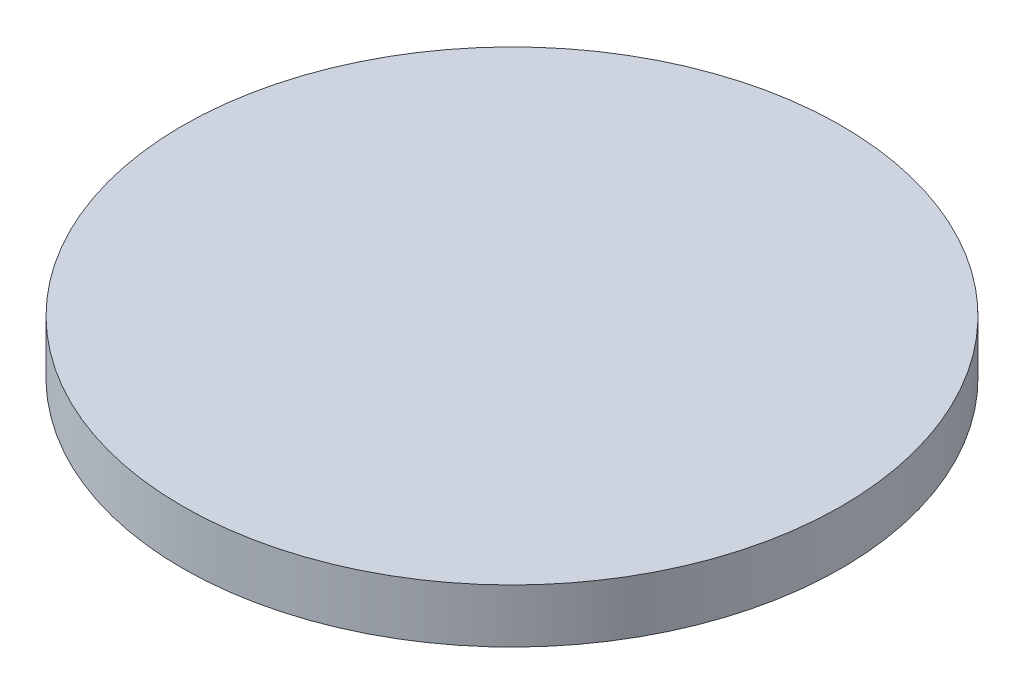
ISO-10303-21;
HEADER;
FILE_DESCRIPTION(('STEP AP214'),'2;1');
FILE_NAME('part.step','',(''),(''),'','','');
FILE_SCHEMA(('AUTOMOTIVE_DESIGN { 1 0 10303 214 1 1 1 1 }'));
ENDSEC;
DATA;
#1=APPLICATION_CONTEXT('core data for automotive mechanical design processes');
#2=APPLICATION_PROTOCOL_DEFINITION('international standard','automotive_design',2000,#1);
#3=PRODUCT_CONTEXT('',#1,'mechanical');
#4=PRODUCT('Part','Part','',(#3));
#5=PRODUCT_RELATED_PRODUCT_CATEGORY('part','',(#4));
#6=PRODUCT_DEFINITION_FORMATION('','',#4);
#7=PRODUCT_DEFINITION_CONTEXT('part definition',#1,'design');
#8=PRODUCT_DEFINITION('design','',#6,#7);
#9=PRODUCT_DEFINITION_SHAPE('','',#8);
#10=(LENGTH_UNIT() NAMED_UNIT(*) SI_UNIT(.MILLI.,.METRE.));
#11=(NAMED_UNIT(*) PLANE_ANGLE_UNIT() SI_UNIT($,.RADIAN.));
#12=(NAMED_UNIT(*) SI_UNIT($,.STERADIAN.) SOLID_ANGLE_UNIT());
#13=UNCERTAINTY_MEASURE_WITH_UNIT(LENGTH_MEASURE(1.E-05),#10,'distance_accuracy_value','');
#14=(GEOMETRIC_REPRESENTATION_CONTEXT(3) GLOBAL_UNCERTAINTY_ASSIGNED_CONTEXT((#13)) GLOBAL_UNIT_ASSIGNED_CONTEXT((#10,
#11,#12)) REPRESENTATION_CONTEXT('',''));
#15=CARTESIAN_POINT('',(0.,0.,0.));
#16=DIRECTION('',(0.,0.,1.));
#17=DIRECTION('',(1.,0.,0.));
#18=AXIS2_PLACEMENT_3D('',#15,#16,#17);
#19=CARTESIAN_POINT('',(67.360135417261,87.9395406480672,103.577321338724));
#20=CARTESIAN_POINT('',(67.8216019712657,87.9395406480672,103.577321338724));
#21=CARTESIAN_POINT('',(68.744535079275,87.9395406480673,103.486420361712));
#22=CARTESIAN_POINT('',(70.0757330386579,87.9395406480672,103.082605875508));
#23=CARTESIAN_POINT('',(71.3025721043753,87.9395406480672,102.426846732863));
#24=CARTESIAN_POINT('',(72.3779055391508,87.9395406480672,101.544343389873));
#25=CARTESIAN_POINT('',(73.26040888214,87.9395406480672,100.469009955098));
#26=CARTESIAN_POINT('',(73.9161680247854,87.9395406480672,99.2421708893806));
#27=CARTESIAN_POINT('',(74.3199825109891,87.9395406480672,97.9109729299976));
#28=CARTESIAN_POINT('',(74.456333976508,87.9395406480672,96.5265732679837));
#29=CARTESIAN_POINT('',(74.3199825109891,87.9395406480672,95.1421736059699));
#30=CARTESIAN_POINT('',(73.9161680247854,87.9395406480672,93.8109756465869));
#31=CARTESIAN_POINT('',(73.26040888214,87.9395406480672,92.5841365808696));
#32=CARTESIAN_POINT('',(72.3779055391508,87.9395406480672,91.508803146094));
#33=CARTESIAN_POINT('',(71.3025721043753,87.9395406480672,90.6262998031048));
#34=CARTESIAN_POINT('',(70.0757330386579,87.9395406480672,89.9705406604594));
#35=CARTESIAN_POINT('',(68.7445350792749,87.9395406480672,89.5667261742557));
#36=CARTESIAN_POINT('',(67.3601354172611,87.9395406480672,89.4303747087368));
#37=CARTESIAN_POINT('',(65.9757357552472,87.9395406480672,89.5667261742557));
#38=CARTESIAN_POINT('',(64.6445377958643,87.9395406480672,89.9705406604594));
#39=CARTESIAN_POINT('',(63.4176987301469,87.9395406480672,90.6262998031048));
#40=CARTESIAN_POINT('',(62.3423652953714,87.9395406480672,91.508803146094));
#41=CARTESIAN_POINT('',(61.4598619523822,87.9395406480672,92.5841365808696));
#42=CARTESIAN_POINT('',(60.8041028097367,87.9395406480672,93.8109756465869));
#43=CARTESIAN_POINT('',(60.4002883235331,87.9395406480672,95.1421736059698));
#44=CARTESIAN_POINT('',(60.2639368580141,87.9395406480672,96.5265732679837));
#45=CARTESIAN_POINT('',(60.4002883235331,87.9395406480672,97.9109729299976));
#46=CARTESIAN_POINT('',(60.8041028097367,87.9395406480672,99.2421708893806));
#47=CARTESIAN_POINT('',(61.4598619523821,87.9395406480672,100.469009955098));
#48=CARTESIAN_POINT('',(62.3423652953714,87.9395406480672,101.544343389873));
#49=CARTESIAN_POINT('',(63.4176987301469,87.9395406480672,102.426846732863));
#50=CARTESIAN_POINT('',(64.6445377958643,87.9395406480672,103.082605875508));
#51=CARTESIAN_POINT('',(65.9757357552472,87.9395406480672,103.486420361712));
#52=CARTESIAN_POINT('',(66.8986688632564,87.9395406480672,103.577321338724));
#53=CARTESIAN_POINT('',(67.360135417261,87.9395406480672,103.577321338724));
#54=B_SPLINE_CURVE_WITH_KNOTS('',3,(#19,#20,#21,#22,#23,#24,#25,#26,#27,#28,#29,#30,#31,#32,#33,
#34,#35,#36,#37,#38,#39,#40,#41,#42,#43,#44,#45,#46,#47,#48,#49,#50,#51,#52,#53),.UNSPECIFIED.,
.T.,.F.,(4,1,1,1,1,1,1,1,1,1,1,1,1,1,1,1,1,1,1,1,1,1,1,1,1,1,1,1,1,1,1,1,4),(0.,
0.0312499999999999,0.0625000000000001,0.0937499999999999,0.125,0.15625,0.1875,0.21875,0.25,
0.28125,0.3125,0.34375,0.375,0.40625,0.4375,0.46875,0.5,0.53125,0.5625,0.59375,0.625,0.65625,
0.6875,0.71875,0.75,0.78125,0.8125,0.84375,0.875,0.90625,0.9375,0.96875,1.),.UNSPECIFIED.);
#55=DIRECTION('',(0.,1.,0.));
#56=VECTOR('',#55,1.);
#57=SURFACE_OF_LINEAR_EXTRUSION('',#54,#56);
#58=CARTESIAN_POINT('',(67.360135417261,87.9395406480672,103.577321338724));
#59=CARTESIAN_POINT('',(67.8216019712657,87.9395406480672,103.577321338724));
#60=CARTESIAN_POINT('',(68.744535079275,87.9395406480673,103.486420361712));
#61=CARTESIAN_POINT('',(70.0757330386579,87.9395406480672,103.082605875508));
#62=CARTESIAN_POINT('',(71.3025721043753,87.9395406480672,102.426846732863));
#63=CARTESIAN_POINT('',(72.3779055391508,87.9395406480672,101.544343389873));
#64=CARTESIAN_POINT('',(73.26040888214,87.9395406480673,100.469009955098));
#65=CARTESIAN_POINT('',(73.9161680247854,87.9395406480672,99.2421708893806));
#66=CARTESIAN_POINT('',(74.3199825109891,87.9395406480672,97.9109729299976));
#67=CARTESIAN_POINT('',(74.456333976508,87.9395406480672,96.5265732679837));
#68=CARTESIAN_POINT('',(74.3199825109891,87.9395406480672,95.1421736059699));
#69=CARTESIAN_POINT('',(73.9161680247854,87.9395406480672,93.8109756465869));
#70=CARTESIAN_POINT('',(73.26040888214,87.9395406480672,92.5841365808696));
#71=CARTESIAN_POINT('',(72.3779055391508,87.9395406480673,91.508803146094));
#72=CARTESIAN_POINT('',(71.3025721043753,87.9395406480672,90.6262998031048));
#73=CARTESIAN_POINT('',(70.0757330386579,87.9395406480672,89.9705406604594));
#74=CARTESIAN_POINT('',(68.7445350792749,87.9395406480673,89.5667261742557));
#75=CARTESIAN_POINT('',(67.3601354172611,87.9395406480672,89.4303747087368));
#76=CARTESIAN_POINT('',(65.9757357552472,87.9395406480672,89.5667261742557));
#77=CARTESIAN_POINT('',(64.6445377958643,87.9395406480673,89.9705406604594));
#78=CARTESIAN_POINT('',(63.4176987301469,87.9395406480673,90.6262998031048));
#79=CARTESIAN_POINT('',(62.3423652953714,87.9395406480672,91.508803146094));
#80=CARTESIAN_POINT('',(61.4598619523822,87.9395406480672,92.5841365808696));
#81=CARTESIAN_POINT('',(60.8041028097367,87.9395406480673,93.8109756465869));
#82=CARTESIAN_POINT('',(60.4002883235331,87.9395406480672,95.1421736059698));
#83=CARTESIAN_POINT('',(60.2639368580141,87.9395406480673,96.5265732679837));
#84=CARTESIAN_POINT('',(60.4002883235331,87.9395406480672,97.9109729299976));
#85=CARTESIAN_POINT('',(60.8041028097367,87.9395406480673,99.2421708893806));
#86=CARTESIAN_POINT('',(61.4598619523821,87.9395406480673,100.469009955098));
#87=CARTESIAN_POINT('',(62.3423652953714,87.9395406480673,101.544343389873));
#88=CARTESIAN_POINT('',(63.4176987301469,87.9395406480672,102.426846732863));
#89=CARTESIAN_POINT('',(64.6445377958643,87.9395406480672,103.082605875508));
#90=CARTESIAN_POINT('',(65.9757357552472,87.9395406480673,103.486420361712));
#91=CARTESIAN_POINT('',(66.8986688632564,87.9395406480672,103.577321338724));
#92=CARTESIAN_POINT('',(67.3601354172611,87.9395406480672,103.577321338724));
#93=B_SPLINE_CURVE_WITH_KNOTS('',3,(#58,#59,#60,#61,#62,#63,#64,#65,#66,#67,#68,#69,#70,#71,#72,
#73,#74,#75,#76,#77,#78,#79,#80,#81,#82,#83,#84,#85,#86,#87,#88,#89,#90,#91,#92),.UNSPECIFIED.,
.T.,.F.,(4,1,1,1,1,1,1,1,1,1,1,1,1,1,1,1,1,1,1,1,1,1,1,1,1,1,1,1,1,1,1,1,4),(0.,
0.0312499999999999,0.0625000000000001,0.0937499999999999,0.125,0.15625,0.1875,0.21875,0.25,
0.28125,0.3125,0.34375,0.375,0.40625,0.4375,0.46875,0.5,0.53125,0.5625,0.59375,0.625,0.65625,
0.6875,0.71875,0.75,0.78125,0.8125,0.84375,0.875,0.90625,0.9375,0.96875,1.),.UNSPECIFIED.);
#94=CARTESIAN_POINT('',(67.360135417261,87.9395406480672,103.577321338724));
#95=VERTEX_POINT('',#94);
#96=EDGE_CURVE('E9',#95,#95,#93,.T.);
#97=ORIENTED_EDGE('',*,*,#96,.T.);
#98=EDGE_LOOP('',(#97));
#99=FACE_BOUND('',#98,.T.);
#100=CARTESIAN_POINT('',(67.360135417261,89.0901863363658,103.577321338724));
#101=CARTESIAN_POINT('',(67.244768070367,89.0901863363658,103.577321314795));
#102=CARTESIAN_POINT('',(67.1294015631018,89.0901863363658,103.574480649268));
#103=CARTESIAN_POINT('',(66.8989456375401,89.0901863363658,103.563145342165));
#104=CARTESIAN_POINT('',(66.783856221403,89.0901863363658,103.554650656669));
#105=CARTESIAN_POINT('',(66.5542316887149,89.0901863363658,103.532034617619));
#106=CARTESIAN_POINT('',(66.4396965721639,89.0901863363658,103.517913264065));
#107=CARTESIAN_POINT('',(66.2114571452356,89.0901863363658,103.484071008509));
#108=CARTESIAN_POINT('',(66.0977528284117,89.0901863363658,103.464350150005));
#109=CARTESIAN_POINT('',(65.8714525829597,89.0901863363658,103.419336233191));
#110=CARTESIAN_POINT('',(65.7588566543316,89.0901863363658,103.394043174881));
#111=CARTESIAN_POINT('',(65.5350400325205,89.0901863363658,103.337965888604));
#112=CARTESIAN_POINT('',(65.4238193500268,89.0901863363658,103.307181617983));
#113=CARTESIAN_POINT('',(65.2030192259303,89.0901863363658,103.24020263269));
#114=CARTESIAN_POINT('',(65.0934397843274,89.0901863363658,103.204007918017));
#115=CARTESIAN_POINT('',(64.8761881925052,89.0901863363658,103.126288624079));
#116=CARTESIAN_POINT('',(64.7685160274769,89.0901863363658,103.084764086218));
#117=CARTESIAN_POINT('',(64.5553458621401,89.0901863363658,102.996466112651));
#118=CARTESIAN_POINT('',(64.4498478618317,89.0901863363658,102.949692676946));
#119=CARTESIAN_POINT('',(64.2412719481937,89.0901863363658,102.851028442853));
#120=CARTESIAN_POINT('',(64.1381940536695,89.0901863363658,102.799137604717));
#121=CARTESIAN_POINT('',(63.9347034942003,89.0901863363658,102.690369634621));
#122=CARTESIAN_POINT('',(63.8342908292553,89.0901863363658,102.633492502661));
#123=CARTESIAN_POINT('',(63.6363759478402,89.0901863363658,102.514882880133));
#124=CARTESIAN_POINT('',(63.5388737087682,89.0901863363658,102.453150427284));
#125=CARTESIAN_POINT('',(63.3470256285061,89.0901863363658,102.324961638327));
#126=CARTESIAN_POINT('',(63.252679787316,89.0901863363658,102.258505302219));
#127=CARTESIAN_POINT('',(63.0673600385672,89.0901863363658,102.12104573156));
#128=CARTESIAN_POINT('',(62.976386157207,89.0901863363658,102.050042461694));
#129=CARTESIAN_POINT('',(62.7980251900915,89.0901863363658,101.90366539887));
#130=CARTESIAN_POINT('',(62.7106381043362,89.0901863363658,101.828291605914));
#131=CARTESIAN_POINT('',(62.5396656913242,89.0901863363658,101.673349756077));
#132=CARTESIAN_POINT('',(62.4560803345415,89.0901863363658,101.593781731781));
#133=CARTESIAN_POINT('',(62.2929269534634,89.0901863363658,101.430628350703));
#134=CARTESIAN_POINT('',(62.2133589291681,89.0901863363658,101.347042993921));
#135=CARTESIAN_POINT('',(62.0584170793312,89.0901863363658,101.176070580909));
#136=CARTESIAN_POINT('',(61.9830432863745,89.0901863363658,101.088683495153));
#137=CARTESIAN_POINT('',(61.8366662235511,89.0901863363658,100.910322528038));
#138=CARTESIAN_POINT('',(61.7656629536844,89.0901863363658,100.819348646678));
#139=CARTESIAN_POINT('',(61.6282033830257,89.0901863363658,100.634028897929));
#140=CARTESIAN_POINT('',(61.5617470469179,89.0901863363658,100.539683056739));
#141=CARTESIAN_POINT('',(61.433558257961,89.0901863363658,100.347834976477));
#142=CARTESIAN_POINT('',(61.371825805112,89.0901863363658,100.250332737405));
#143=CARTESIAN_POINT('',(61.2532161825839,89.0901863363658,100.052417855989));
#144=CARTESIAN_POINT('',(61.1963390506239,89.0901863363658,99.9520051910436));
#145=CARTESIAN_POINT('',(61.0875710805277,89.0901863363658,99.7485146315763));
#146=CARTESIAN_POINT('',(61.0356802423916,89.0901863363658,99.6454367370546));
#147=CARTESIAN_POINT('',(60.9370160082984,89.0901863363658,99.4368608234097));
#148=CARTESIAN_POINT('',(60.8902425725929,89.0901863363658,99.3313628230918));
#149=CARTESIAN_POINT('',(60.8019445990278,89.0901863363658,99.1181926577808));
#150=CARTESIAN_POINT('',(60.7604200611681,89.0901863363658,99.0105204927877));
#151=CARTESIAN_POINT('',(60.6827007672255,89.0901863363658,98.7932689008693));
#152=CARTESIAN_POINT('',(60.6465060525463,89.0901863363658,98.6836894591351));
#153=CARTESIAN_POINT('',(60.5795270672704,89.0901863363658,98.4628893353974));
#154=CARTESIAN_POINT('',(60.5487427966737,89.0901863363658,98.3516686533939));
#155=CARTESIAN_POINT('',(60.4926655103306,89.0901863363658,98.1278520302436));
#156=CARTESIAN_POINT('',(60.4673724519309,89.0901863363658,98.0152560997863));
#157=CARTESIAN_POINT('',(60.4223585353635,89.0901863363658,97.7889558593319));
#158=CARTESIAN_POINT('',(60.4026376771958,89.0901863363658,97.6752515493349));
#159=CARTESIAN_POINT('',(60.3687954207195,89.0901863363658,97.4470121037551));
#160=CARTESIAN_POINT('',(60.354674065908,89.0901863363658,97.3324769617253));
#161=CARTESIAN_POINT('',(60.3320580302943,89.0901863363658,97.1028524986464));
#162=CARTESIAN_POINT('',(60.323563349492,89.0901863363658,96.9877631775972));
#163=CARTESIAN_POINT('',(60.3122280295646,89.0901863363658,96.7573069922514));
#164=CARTESIAN_POINT('',(60.3093873465205,89.0901863363658,96.6419401301176));
#165=CARTESIAN_POINT('',(60.3093873465205,89.0901863363658,96.4112064058499));
#166=CARTESIAN_POINT('',(60.3122280295646,89.0901863363658,96.2958395437161));
#167=CARTESIAN_POINT('',(60.323563349492,89.0901863363658,96.0653833583702));
#168=CARTESIAN_POINT('',(60.3320580302943,89.0901863363658,95.9502940373211));
#169=CARTESIAN_POINT('',(60.354674065908,89.0901863363658,95.7206695742422));
#170=CARTESIAN_POINT('',(60.3687954207195,89.0901863363658,95.6061344322124));
#171=CARTESIAN_POINT('',(60.4026376771958,89.0901863363658,95.3778949866325));
#172=CARTESIAN_POINT('',(60.4223585353635,89.0901863363658,95.2641906766355));
#173=CARTESIAN_POINT('',(60.4673724519309,89.0901863363658,95.0378904361812));
#174=CARTESIAN_POINT('',(60.4926655103306,89.0901863363658,94.9252945057238));
#175=CARTESIAN_POINT('',(60.5487427966737,89.0901863363658,94.7014778825735));
#176=CARTESIAN_POINT('',(60.5795270672704,89.0901863363658,94.5902572005701));
#177=CARTESIAN_POINT('',(60.6465060525463,89.0901863363658,94.3694570768324));
#178=CARTESIAN_POINT('',(60.6827007672255,89.0901863363658,94.2598776350982));
#179=CARTESIAN_POINT('',(60.7604200611681,89.0901863363658,94.0426260431798));
#180=CARTESIAN_POINT('',(60.8019445990278,89.0901863363658,93.9349538781867));
#181=CARTESIAN_POINT('',(60.8902425725929,89.0901863363658,93.7217837128757));
#182=CARTESIAN_POINT('',(60.9370160082983,89.0901863363658,93.6162857125578));
#183=CARTESIAN_POINT('',(61.0356802423916,89.0901863363658,93.4077097989129));
#184=CARTESIAN_POINT('',(61.0875710805277,89.0901863363658,93.3046319043912));
#185=CARTESIAN_POINT('',(61.1963390506239,89.0901863363658,93.1011413449239));
#186=CARTESIAN_POINT('',(61.2532161825839,89.0901863363658,93.0007286799782));
#187=CARTESIAN_POINT('',(61.371825805112,89.0901863363658,92.8028137985626));
#188=CARTESIAN_POINT('',(61.433558257961,89.0901863363658,92.7053115594908));
#189=CARTESIAN_POINT('',(61.5617470469179,89.0901863363658,92.5134634792289));
#190=CARTESIAN_POINT('',(61.6282033830257,89.0901863363658,92.4191176380387));
#191=CARTESIAN_POINT('',(61.7656629536844,89.0901863363658,92.2337978892898));
#192=CARTESIAN_POINT('',(61.8366662235511,89.0901863363658,92.1428240079297));
#193=CARTESIAN_POINT('',(61.9830432863745,89.0901863363658,91.9644630408142));
#194=CARTESIAN_POINT('',(62.0584170793312,89.0901863363658,91.8770759550589));
#195=CARTESIAN_POINT('',(62.2133589291681,89.0901863363658,91.7061035420469));
#196=CARTESIAN_POINT('',(62.2929269534634,89.0901863363658,91.6225181852641));
#197=CARTESIAN_POINT('',(62.4560803345415,89.0901863363658,91.459364804186));
#198=CARTESIAN_POINT('',(62.5396656913242,89.0901863363658,91.3797967798907));
#199=CARTESIAN_POINT('',(62.7106381043362,89.0901863363658,91.2248549300538));
#200=CARTESIAN_POINT('',(62.7980251900916,89.0901863363658,91.1494811370971));
#201=CARTESIAN_POINT('',(62.976386157207,89.0901863363658,91.0031040742738));
#202=CARTESIAN_POINT('',(63.0673600385672,89.0901863363658,90.9321008044071));
#203=CARTESIAN_POINT('',(63.2526797873161,89.0901863363658,90.7946412337484));
#204=CARTESIAN_POINT('',(63.3470256285062,89.0901863363658,90.7281848976405));
#205=CARTESIAN_POINT('',(63.5388737087682,89.0901863363658,90.5999961086837));
#206=CARTESIAN_POINT('',(63.6363759478399,89.0901863363658,90.5382636558347));
#207=CARTESIAN_POINT('',(63.8342908292556,89.0901863363658,90.4196540333066));
#208=CARTESIAN_POINT('',(63.9347034942012,89.0901863363658,90.3627769013465));
#209=CARTESIAN_POINT('',(64.1381940536686,89.0901863363658,90.2540089312504));
#210=CARTESIAN_POINT('',(64.2412719481902,89.0901863363658,90.2021180931143));
#211=CARTESIAN_POINT('',(64.4498478618351,89.0901863363658,90.103453859021));
#212=CARTESIAN_POINT('',(64.555345862153,89.0901863363658,90.0566804233156));
#213=CARTESIAN_POINT('',(64.768516027464,89.0901863363658,89.9683824497505));
#214=CARTESIAN_POINT('',(64.8761881924571,89.0901863363658,89.9268579118907));
#215=CARTESIAN_POINT('',(65.0934397843755,89.0901863363658,89.8491386179482));
#216=CARTESIAN_POINT('',(65.2030192261097,89.0901863363658,89.812943903269));
#217=CARTESIAN_POINT('',(65.4238193498474,89.0901863363658,89.7459649179931));
#218=CARTESIAN_POINT('',(65.5350400318509,89.0901863363658,89.7151806473964));
#219=CARTESIAN_POINT('',(65.7588566550012,89.0901863363658,89.6591033610532));
#220=CARTESIAN_POINT('',(65.8714525854585,89.0901863363658,89.6338103026535));
#221=CARTESIAN_POINT('',(66.0977528259128,89.0901863363658,89.5887963860862));
#222=CARTESIAN_POINT('',(66.2114571359099,89.0901863363658,89.5690755279185));
#223=CARTESIAN_POINT('',(66.4396965814897,89.0901863363658,89.5352332714422));
#224=CARTESIAN_POINT('',(66.5542317235195,89.0901863363658,89.5211119166307));
#225=CARTESIAN_POINT('',(66.7838561865984,89.0901863363658,89.4984958810169));
#226=CARTESIAN_POINT('',(66.8989455076476,89.0901863363658,89.4900012002146));
#227=CARTESIAN_POINT('',(67.1294016929934,89.0901863363658,89.4786658802873));
#228=CARTESIAN_POINT('',(67.2447685551273,89.0901863363658,89.4758251972431));
#229=CARTESIAN_POINT('',(67.4755022793949,89.0901863363658,89.4758251972431));
#230=CARTESIAN_POINT('',(67.5908691415287,89.0901863363658,89.4786658802873));
#231=CARTESIAN_POINT('',(67.8213253268746,89.0901863363658,89.4900012002146));
#232=CARTESIAN_POINT('',(67.9364146479237,89.0901863363658,89.4984958810169));
#233=CARTESIAN_POINT('',(68.1660391110026,89.0901863363658,89.5211119166307));
#234=CARTESIAN_POINT('',(68.2805742530324,89.0901863363658,89.5352332714422));
#235=CARTESIAN_POINT('',(68.5088136986123,89.0901863363658,89.5690755279185));
#236=CARTESIAN_POINT('',(68.6225180086093,89.0901863363658,89.5887963860862));
#237=CARTESIAN_POINT('',(68.8488182490636,89.0901863363658,89.6338103026535));
#238=CARTESIAN_POINT('',(68.961414179521,89.0901863363658,89.6591033610532));
#239=CARTESIAN_POINT('',(69.1852308026712,89.0901863363658,89.7151806473964));
#240=CARTESIAN_POINT('',(69.2964514846747,89.0901863363658,89.7459649179931));
#241=CARTESIAN_POINT('',(69.5172516084124,89.0901863363658,89.812943903269));
#242=CARTESIAN_POINT('',(69.6268310501466,89.0901863363657,89.8491386179482));
#243=CARTESIAN_POINT('',(69.844082642065,89.0901863363657,89.9268579118907));
#244=CARTESIAN_POINT('',(69.9517548070581,89.0901863363657,89.9683824497505));
#245=CARTESIAN_POINT('',(70.1649249723691,89.0901863363657,90.0566804233156));
#246=CARTESIAN_POINT('',(70.270422972687,89.0901863363657,90.103453859021));
#247=CARTESIAN_POINT('',(70.4789988863319,89.0901863363657,90.2021180931143));
#248=CARTESIAN_POINT('',(70.5820767808536,89.0901863363657,90.2540089312504));
#249=CARTESIAN_POINT('',(70.7855673403209,89.0901863363657,90.3627769013465));
#250=CARTESIAN_POINT('',(70.8859800052666,89.0901863363658,90.4196540333066));
#251=CARTESIAN_POINT('',(71.0838948866822,89.0901863363658,90.5382636558346));
#252=CARTESIAN_POINT('',(71.181397125754,89.0901863363658,90.5999961086837));
#253=CARTESIAN_POINT('',(71.3732452060159,89.0901863363658,90.7281848976405));
#254=CARTESIAN_POINT('',(71.4675910472061,89.0901863363658,90.7946412337484));
#255=CARTESIAN_POINT('',(71.652910795955,89.0901863363658,90.9321008044071));
#256=CARTESIAN_POINT('',(71.7438846773151,89.0901863363658,91.0031040742738));
#257=CARTESIAN_POINT('',(71.9222456444306,89.0901863363658,91.1494811370971));
#258=CARTESIAN_POINT('',(72.0096327301859,89.0901863363658,91.2248549300539));
#259=CARTESIAN_POINT('',(72.1806051431979,89.0901863363658,91.3797967798907));
#260=CARTESIAN_POINT('',(72.2641904999807,89.0901863363658,91.459364804186));
#261=CARTESIAN_POINT('',(72.4273438810588,89.0901863363658,91.6225181852641));
#262=CARTESIAN_POINT('',(72.5069119053541,89.0901863363658,91.7061035420469));
#263=CARTESIAN_POINT('',(72.661853755191,89.0901863363658,91.8770759550589));
#264=CARTESIAN_POINT('',(72.7372275481477,89.0901863363658,91.9644630408142));
#265=CARTESIAN_POINT('',(72.8836046109711,89.0901863363658,92.1428240079297));
#266=CARTESIAN_POINT('',(72.9546078808377,89.0901863363658,92.2337978892898));
#267=CARTESIAN_POINT('',(73.0920674514964,89.0901863363658,92.4191176380387));
#268=CARTESIAN_POINT('',(73.1585237876043,89.0901863363658,92.5134634792289));
#269=CARTESIAN_POINT('',(73.2867125765611,89.0901863363658,92.7053115594908));
#270=CARTESIAN_POINT('',(73.3484450294102,89.0901863363658,92.8028137985626));
#271=CARTESIAN_POINT('',(73.4670546519382,89.0901863363658,93.0007286799782));
#272=CARTESIAN_POINT('',(73.5239317838983,89.0901863363658,93.1011413449239));
#273=CARTESIAN_POINT('',(73.6326997539944,89.0901863363658,93.3046319043912));
#274=CARTESIAN_POINT('',(73.6845905921305,89.0901863363658,93.4077097989129));
#275=CARTESIAN_POINT('',(73.7832548262238,89.0901863363658,93.6162857125578));
#276=CARTESIAN_POINT('',(73.8300282619292,89.0901863363658,93.7217837128757));
#277=CARTESIAN_POINT('',(73.9183262354943,89.0901863363658,93.9349538781867));
#278=CARTESIAN_POINT('',(73.959850773354,89.0901863363658,94.0426260431798));
#279=CARTESIAN_POINT('',(74.0375700672966,89.0901863363658,94.2598776350982));
#280=CARTESIAN_POINT('',(74.0737647819758,89.0901863363658,94.3694570768324));
#281=CARTESIAN_POINT('',(74.1407437672517,89.0901863363658,94.5902572005701));
#282=CARTESIAN_POINT('',(74.1715280378485,89.0901863363658,94.7014778825736));
#283=CARTESIAN_POINT('',(74.2276053241916,89.0901863363658,94.9252945057239));
#284=CARTESIAN_POINT('',(74.2528983825913,89.0901863363658,95.0378904361812));
#285=CARTESIAN_POINT('',(74.2979122991586,89.0901863363658,95.2641906766356));
#286=CARTESIAN_POINT('',(74.3176331573263,89.0901863363658,95.3778949866326));
#287=CARTESIAN_POINT('',(74.3514754138026,89.0901863363658,95.6061344322124));
#288=CARTESIAN_POINT('',(74.3655967686141,89.0901863363658,95.7206695742422));
#289=CARTESIAN_POINT('',(74.3882128042279,89.0901863363658,95.9502940373211));
#290=CARTESIAN_POINT('',(74.3967074850302,89.0901863363658,96.0653833583702));
#291=CARTESIAN_POINT('',(74.4080428049575,89.0901863363658,96.2958395437161));
#292=CARTESIAN_POINT('',(74.4108834880017,89.0901863363658,96.4112064058499));
#293=CARTESIAN_POINT('',(74.4108834880017,89.0901863363658,96.6419401301175));
#294=CARTESIAN_POINT('',(74.4080428049575,89.0901863363658,96.7573069922514));
#295=CARTESIAN_POINT('',(74.3967074850302,89.0901863363658,96.9877631775972));
#296=CARTESIAN_POINT('',(74.3882128042279,89.0901863363658,97.1028524986464));
#297=CARTESIAN_POINT('',(74.3655967686141,89.0901863363658,97.3324769617253));
#298=CARTESIAN_POINT('',(74.3514754138026,89.0901863363658,97.4470121037551));
#299=CARTESIAN_POINT('',(74.3176331573263,89.0901863363658,97.6752515493349));
#300=CARTESIAN_POINT('',(74.2979122991586,89.0901863363658,97.7889558593319));
#301=CARTESIAN_POINT('',(74.2528983825913,89.0901863363658,98.0152560997863));
#302=CARTESIAN_POINT('',(74.2276053241916,89.0901863363658,98.1278520302436));
#303=CARTESIAN_POINT('',(74.1715280378484,89.0901863363657,98.3516686533939));
#304=CARTESIAN_POINT('',(74.1407437672517,89.0901863363657,98.4628893353974));
#305=CARTESIAN_POINT('',(74.0737647819758,89.0901863363658,98.6836894591351));
#306=CARTESIAN_POINT('',(74.0375700672966,89.0901863363658,98.7932689008693));
#307=CARTESIAN_POINT('',(73.959850773354,89.0901863363658,99.0105204927877));
#308=CARTESIAN_POINT('',(73.9183262354943,89.0901863363658,99.1181926577808));
#309=CARTESIAN_POINT('',(73.8300282619292,89.0901863363658,99.3313628230918));
#310=CARTESIAN_POINT('',(73.7832548262238,89.0901863363658,99.4368608234097));
#311=CARTESIAN_POINT('',(73.6845905921305,89.0901863363658,99.6454367370546));
#312=CARTESIAN_POINT('',(73.6326997539944,89.0901863363658,99.7485146315762));
#313=CARTESIAN_POINT('',(73.5239317838983,89.0901863363658,99.9520051910436));
#314=CARTESIAN_POINT('',(73.4670546519382,89.0901863363658,100.052417855989));
#315=CARTESIAN_POINT('',(73.3484450294102,89.0901863363658,100.250332737405));
#316=CARTESIAN_POINT('',(73.2867125765611,89.0901863363658,100.347834976477));
#317=CARTESIAN_POINT('',(73.1585237876043,89.0901863363658,100.539683056739));
#318=CARTESIAN_POINT('',(73.0920674514964,89.0901863363658,100.634028897929));
#319=CARTESIAN_POINT('',(72.9546078808377,89.0901863363658,100.819348646678));
#320=CARTESIAN_POINT('',(72.883604610971,89.0901863363658,100.910322528038));
#321=CARTESIAN_POINT('',(72.7372275481477,89.0901863363658,101.088683495153));
#322=CARTESIAN_POINT('',(72.661853755191,89.0901863363658,101.176070580909));
#323=CARTESIAN_POINT('',(72.5069119053541,89.0901863363658,101.347042993921));
#324=CARTESIAN_POINT('',(72.4273438810588,89.0901863363658,101.430628350703));
#325=CARTESIAN_POINT('',(72.2641904999807,89.0901863363658,101.593781731781));
#326=CARTESIAN_POINT('',(72.1806051431979,89.0901863363658,101.673349756077));
#327=CARTESIAN_POINT('',(72.0096327301859,89.0901863363658,101.828291605914));
#328=CARTESIAN_POINT('',(71.9222456444306,89.0901863363658,101.90366539887));
#329=CARTESIAN_POINT('',(71.7438846773151,89.0901863363658,102.050042461694));
#330=CARTESIAN_POINT('',(71.6529107959549,89.0901863363658,102.12104573156));
#331=CARTESIAN_POINT('',(71.4675910472061,89.0901863363658,102.258505302219));
#332=CARTESIAN_POINT('',(71.373245206016,89.0901863363658,102.324961638327));
#333=CARTESIAN_POINT('',(71.1813971257539,89.0901863363658,102.453150427284));
#334=CARTESIAN_POINT('',(71.083894886682,89.0901863363658,102.514882880133));
#335=CARTESIAN_POINT('',(70.8859800052668,89.0901863363658,102.633492502661));
#336=CARTESIAN_POINT('',(70.7855673403218,89.0901863363658,102.690369634621));
#337=CARTESIAN_POINT('',(70.5820767808526,89.0901863363658,102.799137604717));
#338=CARTESIAN_POINT('',(70.4789988863285,89.0901863363658,102.851028442853));
#339=CARTESIAN_POINT('',(70.2704229726905,89.0901863363658,102.949692676946));
#340=CARTESIAN_POINT('',(70.164924972382,89.0901863363658,102.996466112651));
#341=CARTESIAN_POINT('',(69.9517548070453,89.0901863363658,103.084764086218));
#342=CARTESIAN_POINT('',(69.844082642017,89.0901863363658,103.126288624079));
#343=CARTESIAN_POINT('',(69.6268310501947,89.0901863363658,103.204007918017));
#344=CARTESIAN_POINT('',(69.5172516085918,89.0901863363658,103.24020263269));
#345=CARTESIAN_POINT('',(69.2964514844953,89.0901863363658,103.307181617983));
#346=CARTESIAN_POINT('',(69.1852308020017,89.0901863363658,103.337965888604));
#347=CARTESIAN_POINT('',(68.9614141801905,89.0901863363658,103.394043174881));
#348=CARTESIAN_POINT('',(68.8488182515625,89.0901863363658,103.419336233191));
#349=CARTESIAN_POINT('',(68.6225180061105,89.0901863363658,103.464350150005));
#350=CARTESIAN_POINT('',(68.5088136892865,89.0901863363658,103.484071008509));
#351=CARTESIAN_POINT('',(68.2805742623583,89.0901863363658,103.517913264065));
#352=CARTESIAN_POINT('',(68.1660391458073,89.0901863363658,103.532034617619));
#353=CARTESIAN_POINT('',(67.9364146131191,89.0901863363658,103.554650656669));
#354=CARTESIAN_POINT('',(67.821325196982,89.0901863363658,103.563145342165));
#355=CARTESIAN_POINT('',(67.5908692714203,89.0901863363658,103.574480649268));
#356=CARTESIAN_POINT('',(67.4755027641551,89.0901863363657,103.577321314795));
#357=CARTESIAN_POINT('',(67.360135417261,89.0901863363658,103.577321338724));
#358=B_SPLINE_CURVE_WITH_KNOTS('',3,(#100,#101,#102,#103,#104,#105,#106,#107,#108,#109,#110,
#111,#112,#113,#114,#115,#116,#117,#118,#119,#120,#121,#122,#123,#124,#125,#126,#127,#128,#129,
#130,#131,#132,#133,#134,#135,#136,#137,#138,#139,#140,#141,#142,#143,#144,#145,#146,#147,#148,
#149,#150,#151,#152,#153,#154,#155,#156,#157,#158,#159,#160,#161,#162,#163,#164,#165,#166,#167,
#168,#169,#170,#171,#172,#173,#174,#175,#176,#177,#178,#179,#180,#181,#182,#183,#184,#185,#186,
#187,#188,#189,#190,#191,#192,#193,#194,#195,#196,#197,#198,#199,#200,#201,#202,#203,#204,#205,
#206,#207,#208,#209,#210,#211,#212,#213,#214,#215,#216,#217,#218,#219,#220,#221,#222,#223,#224,
#225,#226,#227,#228,#229,#230,#231,#232,#233,#234,#235,#236,#237,#238,#239,#240,#241,#242,#243,
#244,#245,#246,#247,#248,#249,#250,#251,#252,#253,#254,#255,#256,#257,#258,#259,#260,#261,#262,
#263,#264,#265,#266,#267,#268,#269,#270,#271,#272,#273,#274,#275,#276,#277,#278,#279,#280,#281,
#282,#283,#284,#285,#286,#287,#288,#289,#290,#291,#292,#293,#294,#295,#296,#297,#298,#299,#300,
#301,#302,#303,#304,#305,#306,#307,#308,#309,#310,#311,#312,#313,#314,#315,#316,#317,#318,#319,
#320,#321,#322,#323,#324,#325,#326,#327,#328,#329,#330,#331,#332,#333,#334,#335,#336,#337,#338,
#339,#340,#341,#342,#343,#344,#345,#346,#347,#348,#349,#350,#351,#352,#353,#354,#355,#356,#357),
.UNSPECIFIED.,.F.,.F.,(4,2,2,2,2,2,2,2,2,2,2,2,2,2,2,2,2,2,2,2,2,2,2,2,2,2,2,2,2,2,2,2,2,2,2,2,
2,2,2,2,2,2,2,2,2,2,2,2,2,2,2,2,2,2,2,2,2,2,2,2,2,2,2,2,2,2,2,2,2,2,2,2,2,2,2,2,2,2,2,2,2,2,2,2,
2,2,2,2,2,2,2,2,2,2,2,2,2,2,2,2,2,2,2,2,2,2,2,2,2,2,2,2,2,2,2,2,2,2,2,2,2,2,2,2,2,2,2,2,4),(0.,
0.346065977300945,0.692134642803614,1.0382033083063,1.38426928560722,1.73033526290816,
2.07640392841084,2.42247259391353,2.76853857121447,3.11460454851543,3.4606732140181,
3.80674187952079,4.15280785682175,4.49887383412269,4.84494249962535,5.19101116512803,
5.53707714242897,5.88314311972992,6.22921178523259,6.57528045073527,6.92134642803621,
7.26741240533716,7.61348107083983,7.95954973634252,8.30561571364346,8.65168169094443,
8.99775035644709,9.34381902194975,9.68988499925072,10.0359509765517,10.3820196420543,
10.728088307557,11.074154284858,11.4202202621589,11.7662889276616,12.1123575931643,
12.4584235704652,12.8044895477662,13.1505582132689,13.4966268787715,13.8426928560725,
14.1887588333734,14.5348274988761,14.8808961643788,15.2269621416797,15.5730281189807,
15.9190967844834,16.265165449986,16.611231427287,16.9572974045879,17.3033660700906,
17.6494347355933,17.9955007128942,18.3415666901952,18.6876353556979,19.0337040212005,
19.3797699985015,19.7258359758024,20.0719046413051,20.4179733068078,20.7640392841087,
21.1101052614097,21.4561739269123,21.802242592415,22.148308569716,22.4943745470169,
22.8404432125196,23.1865118780223,23.5325778553232,23.8786438326242,24.2247124981268,
24.5707811636295,24.9168471409305,25.2629131182314,25.6089817837341,25.9550504492368,
26.3011164265377,26.6471824038387,26.9932510693413,27.339319734844,27.685385712145,
28.0314516894459,28.3775203549486,28.7235890204513,29.0696549977522,29.4157209750532,
29.7617896405558,30.1078583060585,30.4539242833595,30.7999902606604,31.1460589261631,
31.4921275916658,31.8381935689667,32.1842595462677,32.5303282117704,32.876396877273,
33.222462854574,33.5685288318749,33.9145974973776,34.2606661628803,34.6067321401812,
34.9527981174822,35.2988667829848,35.6449354484875,35.9910014257885,36.3370674030894,
36.6831360685921,37.0292047340948,37.3752707113957,37.7213366886967,38.0674053541994,
38.413474019702,38.759539997003,39.1056059743039,39.4516746398066,39.7977433053093,
40.1438092826102,40.4898752599112,40.8359439254139,41.1820125909165,41.5280785682175,
41.8741445455184,42.2202132110211,42.5662818765238,42.9123478538247,43.2584138311257,
43.6044824966284,43.950551162131,44.296617139432),.UNSPECIFIED.);
#359=CARTESIAN_POINT('',(67.360135417261,89.0901863363658,103.577321338724));
#360=VERTEX_POINT('',#359);
#361=EDGE_CURVE('E24',#360,#360,#358,.F.);
#362=ORIENTED_EDGE('',*,*,#361,.F.);
#363=EDGE_LOOP('',(#362));
#364=FACE_BOUND('',#363,.T.);
#365=ADVANCED_FACE('F14',(#99,#364),#57,.T.);
#366=CARTESIAN_POINT('',(67.3601354172611,87.9395406480672,89.6685732679837));
#367=DIRECTION('',(0.,1.,0.));
#368=DIRECTION('',(-1.,0.,0.));
#369=AXIS2_PLACEMENT_3D('',#366,#367,#368);
#370=PLANE('',#369);
#371=ORIENTED_EDGE('',*,*,#96,.F.);
#372=EDGE_LOOP('',(#371));
#373=FACE_BOUND('',#372,.T.);
#374=ADVANCED_FACE('F62',(#373),#370,.F.);
#375=CARTESIAN_POINT('',(67.3601354172611,89.0901863363658,89.6685732679837));
#376=DIRECTION('',(0.,1.,0.));
#377=DIRECTION('',(-1.,0.,0.));
#378=AXIS2_PLACEMENT_3D('',#375,#376,#377);
#379=PLANE('',#378);
#380=ORIENTED_EDGE('',*,*,#361,.T.);
#381=EDGE_LOOP('',(#380));
#382=FACE_BOUND('',#381,.T.);
#383=ADVANCED_FACE('F31',(#382),#379,.T.);
#384=CLOSED_SHELL('',(#365,#374,#383));
#385=MANIFOLD_SOLID_BREP('B1',#384);
#386=ADVANCED_BREP_SHAPE_REPRESENTATION('',(#18,#385),#14);
#387=SHAPE_DEFINITION_REPRESENTATION(#9,#386);
ENDSEC;
END-ISO-10303-21;
